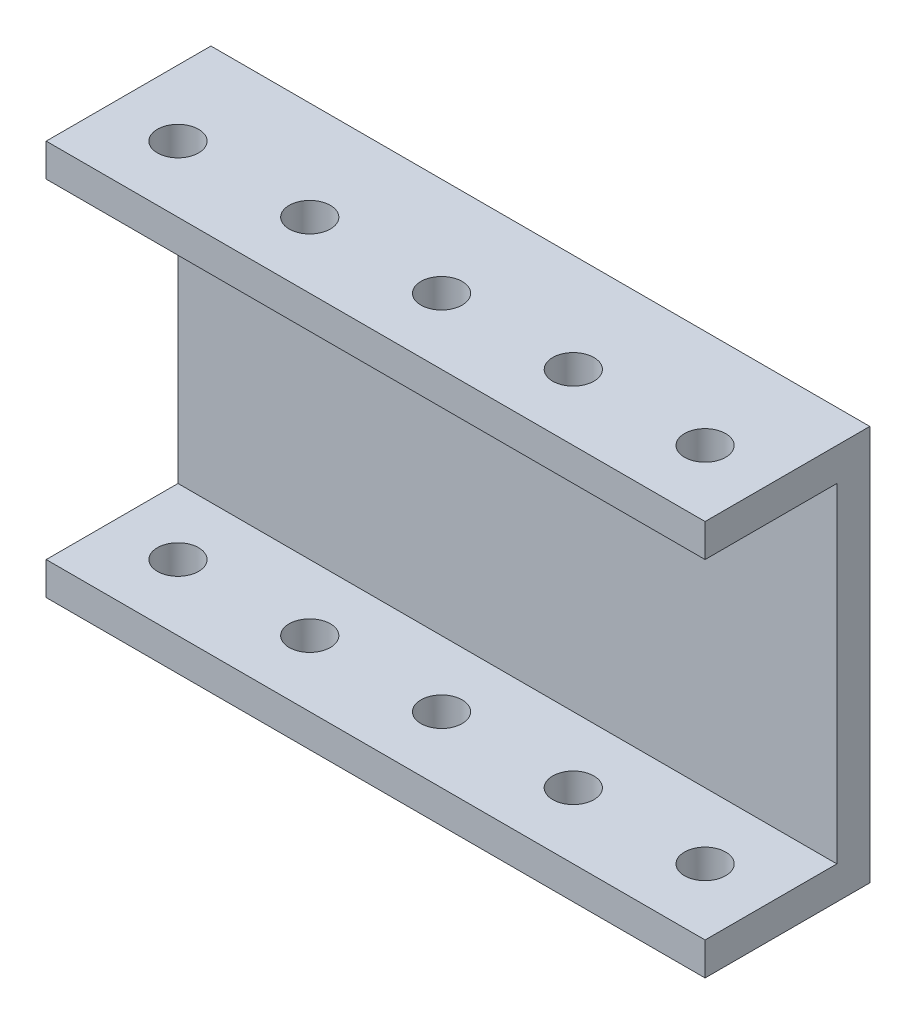
ISO-10303-21;
HEADER;
FILE_DESCRIPTION(('STEP AP214'),'2;1');
FILE_NAME('part.step','',(''),(''),'','','');
FILE_SCHEMA(('AUTOMOTIVE_DESIGN { 1 0 10303 214 1 1 1 1 }'));
ENDSEC;
DATA;
#1=APPLICATION_CONTEXT('core data for automotive mechanical design processes');
#2=APPLICATION_PROTOCOL_DEFINITION('international standard','automotive_design',2000,#1);
#3=PRODUCT_CONTEXT('',#1,'mechanical');
#4=PRODUCT('Part','Part','',(#3));
#5=PRODUCT_RELATED_PRODUCT_CATEGORY('part','',(#4));
#6=PRODUCT_DEFINITION_FORMATION('','',#4);
#7=PRODUCT_DEFINITION_CONTEXT('part definition',#1,'design');
#8=PRODUCT_DEFINITION('design','',#6,#7);
#9=PRODUCT_DEFINITION_SHAPE('','',#8);
#10=(LENGTH_UNIT() NAMED_UNIT(*) SI_UNIT(.MILLI.,.METRE.));
#11=(NAMED_UNIT(*) PLANE_ANGLE_UNIT() SI_UNIT($,.RADIAN.));
#12=(NAMED_UNIT(*) SI_UNIT($,.STERADIAN.) SOLID_ANGLE_UNIT());
#13=UNCERTAINTY_MEASURE_WITH_UNIT(LENGTH_MEASURE(1.E-05),#10,'distance_accuracy_value','');
#14=(GEOMETRIC_REPRESENTATION_CONTEXT(3) GLOBAL_UNCERTAINTY_ASSIGNED_CONTEXT((#13)) GLOBAL_UNIT_ASSIGNED_CONTEXT((#10,
#11,#12)) REPRESENTATION_CONTEXT('',''));
#15=CARTESIAN_POINT('',(0.,0.,0.));
#16=DIRECTION('',(0.,0.,1.));
#17=DIRECTION('',(1.,0.,0.));
#18=AXIS2_PLACEMENT_3D('',#15,#16,#17);
#19=CARTESIAN_POINT('',(127.,32.3974294572796,0.));
#20=DIRECTION('',(0.,1.,0.));
#21=DIRECTION('',(0.,0.,1.));
#22=AXIS2_PLACEMENT_3D('',#19,#20,#21);
#23=PLANE('',#22);
#24=CARTESIAN_POINT('',(12.7,32.3974294572796,-9.89046811553621));
#25=DIRECTION('',(0.,1.,0.));
#26=DIRECTION('',(0.,0.,1.));
#27=AXIS2_PLACEMENT_3D('',#24,#25,#26);
#28=CIRCLE('',#27,3.96874999999999);
#29=CARTESIAN_POINT('',(12.7,32.3974294572796,-5.92171811553622));
#30=VERTEX_POINT('',#29);
#31=EDGE_CURVE('E224',#30,#30,#28,.T.);
#32=ORIENTED_EDGE('',*,*,#31,.T.);
#33=EDGE_LOOP('',(#32));
#34=FACE_BOUND('',#33,.T.);
#35=CARTESIAN_POINT('',(38.1,32.3974294572796,-9.89046811553621));
#36=DIRECTION('',(0.,1.,0.));
#37=DIRECTION('',(0.,0.,1.));
#38=AXIS2_PLACEMENT_3D('',#35,#36,#37);
#39=CIRCLE('',#38,3.96874999999999);
#40=CARTESIAN_POINT('',(38.1,32.3974294572796,-5.92171811553622));
#41=VERTEX_POINT('',#40);
#42=EDGE_CURVE('E212',#41,#41,#39,.T.);
#43=ORIENTED_EDGE('',*,*,#42,.T.);
#44=EDGE_LOOP('',(#43));
#45=FACE_BOUND('',#44,.T.);
#46=CARTESIAN_POINT('',(63.5,32.3974294572796,-9.89046811553621));
#47=DIRECTION('',(0.,1.,0.));
#48=DIRECTION('',(0.,0.,1.));
#49=AXIS2_PLACEMENT_3D('',#46,#47,#48);
#50=CIRCLE('',#49,3.96874999999999);
#51=CARTESIAN_POINT('',(63.5,32.3974294572796,-5.92171811553622));
#52=VERTEX_POINT('',#51);
#53=EDGE_CURVE('E200',#52,#52,#50,.T.);
#54=ORIENTED_EDGE('',*,*,#53,.T.);
#55=EDGE_LOOP('',(#54));
#56=FACE_BOUND('',#55,.T.);
#57=CARTESIAN_POINT('',(88.9,32.3974294572796,-9.89046811553622));
#58=DIRECTION('',(0.,1.,0.));
#59=DIRECTION('',(0.,0.,1.));
#60=AXIS2_PLACEMENT_3D('',#57,#58,#59);
#61=CIRCLE('',#60,3.96874999999999);
#62=CARTESIAN_POINT('',(88.9,32.3974294572796,-5.92171811553623));
#63=VERTEX_POINT('',#62);
#64=EDGE_CURVE('E188',#63,#63,#61,.T.);
#65=ORIENTED_EDGE('',*,*,#64,.T.);
#66=EDGE_LOOP('',(#65));
#67=FACE_BOUND('',#66,.T.);
#68=CARTESIAN_POINT('',(114.3,32.3974294572796,-9.89046811553622));
#69=DIRECTION('',(0.,1.,0.));
#70=DIRECTION('',(0.,0.,1.));
#71=AXIS2_PLACEMENT_3D('',#68,#69,#70);
#72=CIRCLE('',#71,3.96874999999999);
#73=CARTESIAN_POINT('',(114.3,32.3974294572796,-5.92171811553623));
#74=VERTEX_POINT('',#73);
#75=EDGE_CURVE('E136',#74,#74,#72,.T.);
#76=ORIENTED_EDGE('',*,*,#75,.T.);
#77=EDGE_LOOP('',(#76));
#78=FACE_BOUND('',#77,.T.);
#79=DIRECTION('',(0.,0.,-1.));
#80=VECTOR('',#79,1.);
#81=CARTESIAN_POINT('',(0.,32.3974294572796,0.));
#82=LINE('',#81,#80);
#83=CARTESIAN_POINT('',(0.,32.3974294572796,2.80953188446378));
#84=VERTEX_POINT('',#83);
#85=CARTESIAN_POINT('',(0.,32.3974294572796,-22.5904681155362));
#86=VERTEX_POINT('',#85);
#87=EDGE_CURVE('E132',#84,#86,#82,.T.);
#88=ORIENTED_EDGE('',*,*,#87,.T.);
#89=DIRECTION('',(-1.,0.,0.));
#90=VECTOR('',#89,1.);
#91=CARTESIAN_POINT('',(127.,32.3974294572796,-22.5904681155362));
#92=LINE('',#91,#90);
#93=CARTESIAN_POINT('',(127.,32.3974294572796,-22.5904681155362));
#94=VERTEX_POINT('',#93);
#95=EDGE_CURVE('E11',#94,#86,#92,.T.);
#96=ORIENTED_EDGE('',*,*,#95,.F.);
#97=DIRECTION('',(0.,0.,-1.));
#98=VECTOR('',#97,1.);
#99=CARTESIAN_POINT('',(127.,32.3974294572796,0.));
#100=LINE('',#99,#98);
#101=CARTESIAN_POINT('',(127.,32.3974294572796,2.80953188446378));
#102=VERTEX_POINT('',#101);
#103=EDGE_CURVE('E151',#102,#94,#100,.T.);
#104=ORIENTED_EDGE('',*,*,#103,.F.);
#105=DIRECTION('',(-1.,0.,0.));
#106=VECTOR('',#105,1.);
#107=CARTESIAN_POINT('',(127.,32.3974294572796,2.80953188446378));
#108=LINE('',#107,#106);
#109=EDGE_CURVE('E128',#102,#84,#108,.T.);
#110=ORIENTED_EDGE('',*,*,#109,.T.);
#111=EDGE_LOOP('',(#88,#96,#104,#110));
#112=FACE_BOUND('',#111,.T.);
#113=ADVANCED_FACE('F37',(#34,#45,#56,#67,#78,#112),#23,.F.);
#114=CARTESIAN_POINT('',(127.,0.,-22.5904681155362));
#115=DIRECTION('',(0.,0.,-1.));
#116=DIRECTION('',(-1.,0.,0.));
#117=AXIS2_PLACEMENT_3D('',#114,#115,#116);
#118=PLANE('',#117);
#119=DIRECTION('',(0.,-1.,0.));
#120=VECTOR('',#119,1.);
#121=CARTESIAN_POINT('',(0.,0.,-22.5904681155362));
#122=LINE('',#121,#120);
#123=CARTESIAN_POINT('',(0.,-31.1025705427204,-22.5904681155362));
#124=VERTEX_POINT('',#123);
#125=EDGE_CURVE('E135',#86,#124,#122,.T.);
#126=ORIENTED_EDGE('',*,*,#125,.T.);
#127=DIRECTION('',(-1.,0.,0.));
#128=VECTOR('',#127,1.);
#129=CARTESIAN_POINT('',(127.,-31.1025705427204,-22.5904681155362));
#130=LINE('',#129,#128);
#131=CARTESIAN_POINT('',(127.,-31.1025705427204,-22.5904681155362));
#132=VERTEX_POINT('',#131);
#133=EDGE_CURVE('E45',#132,#124,#130,.T.);
#134=ORIENTED_EDGE('',*,*,#133,.F.);
#135=DIRECTION('',(0.,-1.,0.));
#136=VECTOR('',#135,1.);
#137=CARTESIAN_POINT('',(127.,0.,-22.5904681155362));
#138=LINE('',#137,#136);
#139=EDGE_CURVE('E92',#94,#132,#138,.T.);
#140=ORIENTED_EDGE('',*,*,#139,.F.);
#141=ORIENTED_EDGE('',*,*,#95,.T.);
#142=EDGE_LOOP('',(#126,#134,#140,#141));
#143=FACE_BOUND('',#142,.T.);
#144=ADVANCED_FACE('F251',(#143),#118,.F.);
#145=CARTESIAN_POINT('',(127.,-31.1025705427204,0.));
#146=DIRECTION('',(0.,-1.,0.));
#147=DIRECTION('',(0.,0.,-1.));
#148=AXIS2_PLACEMENT_3D('',#145,#146,#147);
#149=PLANE('',#148);
#150=CARTESIAN_POINT('',(12.7,-31.1025705427204,-9.89046811553621));
#151=DIRECTION('',(0.,-1.,0.));
#152=DIRECTION('',(0.,0.,-1.));
#153=AXIS2_PLACEMENT_3D('',#150,#151,#152);
#154=CIRCLE('',#153,3.96874999999999);
#155=CARTESIAN_POINT('',(12.7,-31.1025705427204,-13.8592181155362));
#156=VERTEX_POINT('',#155);
#157=EDGE_CURVE('E229',#156,#156,#154,.T.);
#158=ORIENTED_EDGE('',*,*,#157,.T.);
#159=EDGE_LOOP('',(#158));
#160=FACE_BOUND('',#159,.T.);
#161=CARTESIAN_POINT('',(38.1,-31.1025705427204,-9.89046811553621));
#162=DIRECTION('',(0.,-1.,0.));
#163=DIRECTION('',(0.,0.,-1.));
#164=AXIS2_PLACEMENT_3D('',#161,#162,#163);
#165=CIRCLE('',#164,3.96874999999999);
#166=CARTESIAN_POINT('',(38.1,-31.1025705427204,-13.8592181155362));
#167=VERTEX_POINT('',#166);
#168=EDGE_CURVE('E217',#167,#167,#165,.T.);
#169=ORIENTED_EDGE('',*,*,#168,.T.);
#170=EDGE_LOOP('',(#169));
#171=FACE_BOUND('',#170,.T.);
#172=CARTESIAN_POINT('',(63.5,-31.1025705427204,-9.89046811553621));
#173=DIRECTION('',(0.,-1.,0.));
#174=DIRECTION('',(0.,0.,-1.));
#175=AXIS2_PLACEMENT_3D('',#172,#173,#174);
#176=CIRCLE('',#175,3.96874999999999);
#177=CARTESIAN_POINT('',(63.5,-31.1025705427204,-13.8592181155362));
#178=VERTEX_POINT('',#177);
#179=EDGE_CURVE('E205',#178,#178,#176,.T.);
#180=ORIENTED_EDGE('',*,*,#179,.T.);
#181=EDGE_LOOP('',(#180));
#182=FACE_BOUND('',#181,.T.);
#183=CARTESIAN_POINT('',(88.9,-31.1025705427204,-9.89046811553622));
#184=DIRECTION('',(0.,-1.,0.));
#185=DIRECTION('',(0.,0.,-1.));
#186=AXIS2_PLACEMENT_3D('',#183,#184,#185);
#187=CIRCLE('',#186,3.96874999999999);
#188=CARTESIAN_POINT('',(88.9,-31.1025705427204,-13.8592181155362));
#189=VERTEX_POINT('',#188);
#190=EDGE_CURVE('E193',#189,#189,#187,.T.);
#191=ORIENTED_EDGE('',*,*,#190,.T.);
#192=EDGE_LOOP('',(#191));
#193=FACE_BOUND('',#192,.T.);
#194=CARTESIAN_POINT('',(114.3,-31.1025705427204,-9.89046811553622));
#195=DIRECTION('',(0.,-1.,0.));
#196=DIRECTION('',(0.,0.,-1.));
#197=AXIS2_PLACEMENT_3D('',#194,#195,#196);
#198=CIRCLE('',#197,3.96874999999999);
#199=CARTESIAN_POINT('',(114.3,-31.1025705427204,-13.8592181155362));
#200=VERTEX_POINT('',#199);
#201=EDGE_CURVE('E181',#200,#200,#198,.T.);
#202=ORIENTED_EDGE('',*,*,#201,.T.);
#203=EDGE_LOOP('',(#202));
#204=FACE_BOUND('',#203,.T.);
#205=DIRECTION('',(0.,0.,1.));
#206=VECTOR('',#205,1.);
#207=CARTESIAN_POINT('',(0.,-31.1025705427204,0.));
#208=LINE('',#207,#206);
#209=CARTESIAN_POINT('',(0.,-31.1025705427204,2.80953188446379));
#210=VERTEX_POINT('',#209);
#211=EDGE_CURVE('E138',#124,#210,#208,.T.);
#212=ORIENTED_EDGE('',*,*,#211,.T.);
#213=DIRECTION('',(-1.,0.,0.));
#214=VECTOR('',#213,1.);
#215=CARTESIAN_POINT('',(127.,-31.1025705427204,2.80953188446379));
#216=LINE('',#215,#214);
#217=CARTESIAN_POINT('',(127.,-31.1025705427204,2.80953188446379));
#218=VERTEX_POINT('',#217);
#219=EDGE_CURVE('E157',#218,#210,#216,.T.);
#220=ORIENTED_EDGE('',*,*,#219,.F.);
#221=DIRECTION('',(0.,0.,1.));
#222=VECTOR('',#221,1.);
#223=CARTESIAN_POINT('',(127.,-31.1025705427204,0.));
#224=LINE('',#223,#222);
#225=EDGE_CURVE('E164',#132,#218,#224,.T.);
#226=ORIENTED_EDGE('',*,*,#225,.F.);
#227=ORIENTED_EDGE('',*,*,#133,.T.);
#228=EDGE_LOOP('',(#212,#220,#226,#227));
#229=FACE_BOUND('',#228,.T.);
#230=ADVANCED_FACE('F162',(#160,#171,#182,#193,#204,#229),#149,.F.);
#231=CARTESIAN_POINT('',(127.,0.,2.80953188446379));
#232=DIRECTION('',(0.,0.,1.));
#233=DIRECTION('',(0.,-1.,0.));
#234=AXIS2_PLACEMENT_3D('',#231,#232,#233);
#235=PLANE('',#234);
#236=DIRECTION('',(0.,1.,0.));
#237=VECTOR('',#236,1.);
#238=CARTESIAN_POINT('',(0.,0.,2.80953188446379));
#239=LINE('',#238,#237);
#240=CARTESIAN_POINT('',(0.,-37.4525705427204,2.80953188446378));
#241=VERTEX_POINT('',#240);
#242=EDGE_CURVE('E141',#241,#210,#239,.T.);
#243=ORIENTED_EDGE('',*,*,#242,.F.);
#244=DIRECTION('',(-1.,0.,0.));
#245=VECTOR('',#244,1.);
#246=CARTESIAN_POINT('',(127.,-37.4525705427204,2.80953188446378));
#247=LINE('',#246,#245);
#248=CARTESIAN_POINT('',(127.,-37.4525705427204,2.80953188446378));
#249=VERTEX_POINT('',#248);
#250=EDGE_CURVE('E155',#249,#241,#247,.T.);
#251=ORIENTED_EDGE('',*,*,#250,.F.);
#252=DIRECTION('',(0.,1.,0.));
#253=VECTOR('',#252,1.);
#254=CARTESIAN_POINT('',(127.,0.,2.80953188446379));
#255=LINE('',#254,#253);
#256=EDGE_CURVE('E173',#249,#218,#255,.T.);
#257=ORIENTED_EDGE('',*,*,#256,.T.);
#258=ORIENTED_EDGE('',*,*,#219,.T.);
#259=EDGE_LOOP('',(#243,#251,#257,#258));
#260=FACE_BOUND('',#259,.T.);
#261=ADVANCED_FACE('F171',(#260),#235,.T.);
#262=CARTESIAN_POINT('',(127.,-37.4525705427204,0.));
#263=DIRECTION('',(0.,1.,0.));
#264=DIRECTION('',(0.,0.,1.));
#265=AXIS2_PLACEMENT_3D('',#262,#263,#264);
#266=PLANE('',#265);
#267=CARTESIAN_POINT('',(12.7,-37.4525705427204,-9.89046811553621));
#268=DIRECTION('',(0.,1.,0.));
#269=DIRECTION('',(0.,0.,1.));
#270=AXIS2_PLACEMENT_3D('',#267,#268,#269);
#271=CIRCLE('',#270,3.96874999999999);
#272=CARTESIAN_POINT('',(12.7,-37.4525705427204,-5.92171811553622));
#273=VERTEX_POINT('',#272);
#274=EDGE_CURVE('E232',#273,#273,#271,.T.);
#275=ORIENTED_EDGE('',*,*,#274,.T.);
#276=EDGE_LOOP('',(#275));
#277=FACE_BOUND('',#276,.T.);
#278=CARTESIAN_POINT('',(38.1,-37.4525705427204,-9.89046811553621));
#279=DIRECTION('',(0.,1.,0.));
#280=DIRECTION('',(0.,0.,1.));
#281=AXIS2_PLACEMENT_3D('',#278,#279,#280);
#282=CIRCLE('',#281,3.96874999999999);
#283=CARTESIAN_POINT('',(38.1,-37.4525705427204,-5.92171811553622));
#284=VERTEX_POINT('',#283);
#285=EDGE_CURVE('E220',#284,#284,#282,.T.);
#286=ORIENTED_EDGE('',*,*,#285,.T.);
#287=EDGE_LOOP('',(#286));
#288=FACE_BOUND('',#287,.T.);
#289=CARTESIAN_POINT('',(63.5,-37.4525705427204,-9.89046811553621));
#290=DIRECTION('',(0.,1.,0.));
#291=DIRECTION('',(0.,0.,1.));
#292=AXIS2_PLACEMENT_3D('',#289,#290,#291);
#293=CIRCLE('',#292,3.96874999999999);
#294=CARTESIAN_POINT('',(63.5,-37.4525705427204,-5.92171811553622));
#295=VERTEX_POINT('',#294);
#296=EDGE_CURVE('E208',#295,#295,#293,.T.);
#297=ORIENTED_EDGE('',*,*,#296,.T.);
#298=EDGE_LOOP('',(#297));
#299=FACE_BOUND('',#298,.T.);
#300=CARTESIAN_POINT('',(88.9,-37.4525705427204,-9.89046811553622));
#301=DIRECTION('',(0.,1.,0.));
#302=DIRECTION('',(0.,0.,1.));
#303=AXIS2_PLACEMENT_3D('',#300,#301,#302);
#304=CIRCLE('',#303,3.96874999999999);
#305=CARTESIAN_POINT('',(88.9,-37.4525705427204,-5.92171811553623));
#306=VERTEX_POINT('',#305);
#307=EDGE_CURVE('E196',#306,#306,#304,.T.);
#308=ORIENTED_EDGE('',*,*,#307,.T.);
#309=EDGE_LOOP('',(#308));
#310=FACE_BOUND('',#309,.T.);
#311=CARTESIAN_POINT('',(114.3,-37.4525705427204,-9.89046811553622));
#312=DIRECTION('',(0.,1.,0.));
#313=DIRECTION('',(0.,0.,1.));
#314=AXIS2_PLACEMENT_3D('',#311,#312,#313);
#315=CIRCLE('',#314,3.96874999999999);
#316=CARTESIAN_POINT('',(114.3,-37.4525705427204,-5.92171811553623));
#317=VERTEX_POINT('',#316);
#318=EDGE_CURVE('E184',#317,#317,#315,.T.);
#319=ORIENTED_EDGE('',*,*,#318,.T.);
#320=EDGE_LOOP('',(#319));
#321=FACE_BOUND('',#320,.T.);
#322=DIRECTION('',(0.,0.,-1.));
#323=VECTOR('',#322,1.);
#324=CARTESIAN_POINT('',(0.,-37.4525705427204,0.));
#325=LINE('',#324,#323);
#326=CARTESIAN_POINT('',(0.,-37.4525705427204,-28.9404681155362));
#327=VERTEX_POINT('',#326);
#328=EDGE_CURVE('E144',#241,#327,#325,.T.);
#329=ORIENTED_EDGE('',*,*,#328,.T.);
#330=DIRECTION('',(-1.,0.,0.));
#331=VECTOR('',#330,1.);
#332=CARTESIAN_POINT('',(127.,-37.4525705427204,-28.9404681155362));
#333=LINE('',#332,#331);
#334=CARTESIAN_POINT('',(127.,-37.4525705427204,-28.9404681155362));
#335=VERTEX_POINT('',#334);
#336=EDGE_CURVE('E117',#335,#327,#333,.T.);
#337=ORIENTED_EDGE('',*,*,#336,.F.);
#338=DIRECTION('',(0.,0.,-1.));
#339=VECTOR('',#338,1.);
#340=CARTESIAN_POINT('',(127.,-37.4525705427204,0.));
#341=LINE('',#340,#339);
#342=EDGE_CURVE('E123',#249,#335,#341,.T.);
#343=ORIENTED_EDGE('',*,*,#342,.F.);
#344=ORIENTED_EDGE('',*,*,#250,.T.);
#345=EDGE_LOOP('',(#329,#337,#343,#344));
#346=FACE_BOUND('',#345,.T.);
#347=ADVANCED_FACE('F239',(#277,#288,#299,#310,#321,#346),#266,.F.);
#348=CARTESIAN_POINT('',(127.,0.,-28.9404681155362));
#349=DIRECTION('',(0.,0.,-1.));
#350=DIRECTION('',(0.,1.,0.));
#351=AXIS2_PLACEMENT_3D('',#348,#349,#350);
#352=PLANE('',#351);
#353=DIRECTION('',(0.,-1.,0.));
#354=VECTOR('',#353,1.);
#355=CARTESIAN_POINT('',(0.,0.,-28.9404681155362));
#356=LINE('',#355,#354);
#357=CARTESIAN_POINT('',(0.,38.7474294572796,-28.9404681155362));
#358=VERTEX_POINT('',#357);
#359=EDGE_CURVE('E112',#358,#327,#356,.T.);
#360=ORIENTED_EDGE('',*,*,#359,.F.);
#361=DIRECTION('',(-1.,0.,0.));
#362=VECTOR('',#361,1.);
#363=CARTESIAN_POINT('',(127.,38.7474294572796,-28.9404681155362));
#364=LINE('',#363,#362);
#365=CARTESIAN_POINT('',(127.,38.7474294572796,-28.9404681155362));
#366=VERTEX_POINT('',#365);
#367=EDGE_CURVE('E107',#366,#358,#364,.T.);
#368=ORIENTED_EDGE('',*,*,#367,.F.);
#369=DIRECTION('',(0.,-1.,0.));
#370=VECTOR('',#369,1.);
#371=CARTESIAN_POINT('',(127.,0.,-28.9404681155362));
#372=LINE('',#371,#370);
#373=EDGE_CURVE('E110',#366,#335,#372,.T.);
#374=ORIENTED_EDGE('',*,*,#373,.T.);
#375=ORIENTED_EDGE('',*,*,#336,.T.);
#376=EDGE_LOOP('',(#360,#368,#374,#375));
#377=FACE_BOUND('',#376,.T.);
#378=ADVANCED_FACE('F109',(#377),#352,.T.);
#379=CARTESIAN_POINT('',(127.,38.7474294572796,0.));
#380=DIRECTION('',(0.,1.,0.));
#381=DIRECTION('',(0.,0.,1.));
#382=AXIS2_PLACEMENT_3D('',#379,#380,#381);
#383=PLANE('',#382);
#384=CARTESIAN_POINT('',(12.7,38.7474294572796,-9.89046811553621));
#385=DIRECTION('',(0.,1.,0.));
#386=DIRECTION('',(0.,0.,1.));
#387=AXIS2_PLACEMENT_3D('',#384,#385,#386);
#388=CIRCLE('',#387,3.96874999999999);
#389=CARTESIAN_POINT('',(12.7,38.7474294572796,-5.92171811553622));
#390=VERTEX_POINT('',#389);
#391=EDGE_CURVE('E233',#390,#390,#388,.T.);
#392=ORIENTED_EDGE('',*,*,#391,.F.);
#393=EDGE_LOOP('',(#392));
#394=FACE_BOUND('',#393,.T.);
#395=CARTESIAN_POINT('',(38.1,38.7474294572796,-9.89046811553621));
#396=DIRECTION('',(0.,1.,0.));
#397=DIRECTION('',(0.,0.,1.));
#398=AXIS2_PLACEMENT_3D('',#395,#396,#397);
#399=CIRCLE('',#398,3.96874999999999);
#400=CARTESIAN_POINT('',(38.1,38.7474294572796,-5.92171811553622));
#401=VERTEX_POINT('',#400);
#402=EDGE_CURVE('E221',#401,#401,#399,.T.);
#403=ORIENTED_EDGE('',*,*,#402,.F.);
#404=EDGE_LOOP('',(#403));
#405=FACE_BOUND('',#404,.T.);
#406=CARTESIAN_POINT('',(63.5,38.7474294572796,-9.89046811553621));
#407=DIRECTION('',(0.,1.,0.));
#408=DIRECTION('',(0.,0.,1.));
#409=AXIS2_PLACEMENT_3D('',#406,#407,#408);
#410=CIRCLE('',#409,3.96874999999999);
#411=CARTESIAN_POINT('',(63.5,38.7474294572796,-5.92171811553622));
#412=VERTEX_POINT('',#411);
#413=EDGE_CURVE('E209',#412,#412,#410,.T.);
#414=ORIENTED_EDGE('',*,*,#413,.F.);
#415=EDGE_LOOP('',(#414));
#416=FACE_BOUND('',#415,.T.);
#417=CARTESIAN_POINT('',(88.9,38.7474294572796,-9.89046811553622));
#418=DIRECTION('',(0.,1.,0.));
#419=DIRECTION('',(0.,0.,1.));
#420=AXIS2_PLACEMENT_3D('',#417,#418,#419);
#421=CIRCLE('',#420,3.96874999999999);
#422=CARTESIAN_POINT('',(88.9,38.7474294572796,-5.92171811553623));
#423=VERTEX_POINT('',#422);
#424=EDGE_CURVE('E197',#423,#423,#421,.T.);
#425=ORIENTED_EDGE('',*,*,#424,.F.);
#426=EDGE_LOOP('',(#425));
#427=FACE_BOUND('',#426,.T.);
#428=CARTESIAN_POINT('',(114.3,38.7474294572796,-9.89046811553622));
#429=DIRECTION('',(0.,1.,0.));
#430=DIRECTION('',(0.,0.,1.));
#431=AXIS2_PLACEMENT_3D('',#428,#429,#430);
#432=CIRCLE('',#431,3.96874999999999);
#433=CARTESIAN_POINT('',(114.3,38.7474294572796,-5.92171811553623));
#434=VERTEX_POINT('',#433);
#435=EDGE_CURVE('E185',#434,#434,#432,.T.);
#436=ORIENTED_EDGE('',*,*,#435,.F.);
#437=EDGE_LOOP('',(#436));
#438=FACE_BOUND('',#437,.T.);
#439=DIRECTION('',(0.,0.,-1.));
#440=VECTOR('',#439,1.);
#441=CARTESIAN_POINT('',(0.,38.7474294572796,0.));
#442=LINE('',#441,#440);
#443=CARTESIAN_POINT('',(0.,38.7474294572796,2.80953188446378));
#444=VERTEX_POINT('',#443);
#445=EDGE_CURVE('E148',#444,#358,#442,.T.);
#446=ORIENTED_EDGE('',*,*,#445,.F.);
#447=DIRECTION('',(-1.,0.,0.));
#448=VECTOR('',#447,1.);
#449=CARTESIAN_POINT('',(127.,38.7474294572796,2.80953188446378));
#450=LINE('',#449,#448);
#451=CARTESIAN_POINT('',(127.,38.7474294572796,2.80953188446378));
#452=VERTEX_POINT('',#451);
#453=EDGE_CURVE('E81',#452,#444,#450,.T.);
#454=ORIENTED_EDGE('',*,*,#453,.F.);
#455=DIRECTION('',(0.,0.,-1.));
#456=VECTOR('',#455,1.);
#457=CARTESIAN_POINT('',(127.,38.7474294572796,0.));
#458=LINE('',#457,#456);
#459=EDGE_CURVE('E120',#452,#366,#458,.T.);
#460=ORIENTED_EDGE('',*,*,#459,.T.);
#461=ORIENTED_EDGE('',*,*,#367,.T.);
#462=EDGE_LOOP('',(#446,#454,#460,#461));
#463=FACE_BOUND('',#462,.T.);
#464=ADVANCED_FACE('F126',(#394,#405,#416,#427,#438,#463),#383,.T.);
#465=CARTESIAN_POINT('',(127.,0.,2.80953188446378));
#466=DIRECTION('',(0.,0.,-1.));
#467=DIRECTION('',(0.,1.,0.));
#468=AXIS2_PLACEMENT_3D('',#465,#466,#467);
#469=PLANE('',#468);
#470=DIRECTION('',(0.,-1.,0.));
#471=VECTOR('',#470,1.);
#472=CARTESIAN_POINT('',(0.,0.,2.80953188446378));
#473=LINE('',#472,#471);
#474=EDGE_CURVE('E84',#444,#84,#473,.T.);
#475=ORIENTED_EDGE('',*,*,#474,.T.);
#476=ORIENTED_EDGE('',*,*,#109,.F.);
#477=DIRECTION('',(0.,-1.,0.));
#478=VECTOR('',#477,1.);
#479=CARTESIAN_POINT('',(127.,0.,2.80953188446378));
#480=LINE('',#479,#478);
#481=EDGE_CURVE('E53',#452,#102,#480,.T.);
#482=ORIENTED_EDGE('',*,*,#481,.F.);
#483=ORIENTED_EDGE('',*,*,#453,.T.);
#484=EDGE_LOOP('',(#475,#476,#482,#483));
#485=FACE_BOUND('',#484,.T.);
#486=ADVANCED_FACE('F294',(#485),#469,.F.);
#487=CARTESIAN_POINT('',(127.,0.,0.));
#488=DIRECTION('',(1.,0.,0.));
#489=DIRECTION('',(0.,0.,-1.));
#490=AXIS2_PLACEMENT_3D('',#487,#488,#489);
#491=PLANE('',#490);
#492=ORIENTED_EDGE('',*,*,#103,.T.);
#493=ORIENTED_EDGE('',*,*,#139,.T.);
#494=ORIENTED_EDGE('',*,*,#225,.T.);
#495=ORIENTED_EDGE('',*,*,#256,.F.);
#496=ORIENTED_EDGE('',*,*,#342,.T.);
#497=ORIENTED_EDGE('',*,*,#373,.F.);
#498=ORIENTED_EDGE('',*,*,#459,.F.);
#499=ORIENTED_EDGE('',*,*,#481,.T.);
#500=EDGE_LOOP('',(#492,#493,#494,#495,#496,#497,#498,#499));
#501=FACE_BOUND('',#500,.T.);
#502=ADVANCED_FACE('F119',(#501),#491,.T.);
#503=CARTESIAN_POINT('',(0.,0.,0.));
#504=DIRECTION('',(1.,0.,0.));
#505=DIRECTION('',(0.,0.,-1.));
#506=AXIS2_PLACEMENT_3D('',#503,#504,#505);
#507=PLANE('',#506);
#508=ORIENTED_EDGE('',*,*,#87,.F.);
#509=ORIENTED_EDGE('',*,*,#474,.F.);
#510=ORIENTED_EDGE('',*,*,#445,.T.);
#511=ORIENTED_EDGE('',*,*,#359,.T.);
#512=ORIENTED_EDGE('',*,*,#328,.F.);
#513=ORIENTED_EDGE('',*,*,#242,.T.);
#514=ORIENTED_EDGE('',*,*,#211,.F.);
#515=ORIENTED_EDGE('',*,*,#125,.F.);
#516=EDGE_LOOP('',(#508,#509,#510,#511,#512,#513,#514,#515));
#517=FACE_BOUND('',#516,.T.);
#518=ADVANCED_FACE('F167',(#517),#507,.F.);
#519=CARTESIAN_POINT('',(114.3,-37.4525705427204,-9.89046811553622));
#520=DIRECTION('',(0.,1.,0.));
#521=DIRECTION('',(0.,0.,1.));
#522=AXIS2_PLACEMENT_3D('',#519,#520,#521);
#523=CYLINDRICAL_SURFACE('',#522,3.96874999999999);
#524=ORIENTED_EDGE('',*,*,#435,.T.);
#525=EDGE_LOOP('',(#524));
#526=FACE_BOUND('',#525,.T.);
#527=ORIENTED_EDGE('',*,*,#75,.F.);
#528=EDGE_LOOP('',(#527));
#529=FACE_BOUND('',#528,.T.);
#530=ADVANCED_FACE('F264',(#526,#529),#523,.F.);
#531=ORIENTED_EDGE('',*,*,#318,.F.);
#532=EDGE_LOOP('',(#531));
#533=FACE_BOUND('',#532,.T.);
#534=ORIENTED_EDGE('',*,*,#201,.F.);
#535=EDGE_LOOP('',(#534));
#536=FACE_BOUND('',#535,.T.);
#537=ADVANCED_FACE('F261',(#533,#536),#523,.F.);
#538=CARTESIAN_POINT('',(88.9,-37.4525705427204,-9.89046811553622));
#539=DIRECTION('',(0.,1.,0.));
#540=DIRECTION('',(0.,0.,1.));
#541=AXIS2_PLACEMENT_3D('',#538,#539,#540);
#542=CYLINDRICAL_SURFACE('',#541,3.96874999999999);
#543=ORIENTED_EDGE('',*,*,#424,.T.);
#544=EDGE_LOOP('',(#543));
#545=FACE_BOUND('',#544,.T.);
#546=ORIENTED_EDGE('',*,*,#64,.F.);
#547=EDGE_LOOP('',(#546));
#548=FACE_BOUND('',#547,.T.);
#549=ADVANCED_FACE('F263',(#545,#548),#542,.F.);
#550=ORIENTED_EDGE('',*,*,#307,.F.);
#551=EDGE_LOOP('',(#550));
#552=FACE_BOUND('',#551,.T.);
#553=ORIENTED_EDGE('',*,*,#190,.F.);
#554=EDGE_LOOP('',(#553));
#555=FACE_BOUND('',#554,.T.);
#556=ADVANCED_FACE('F271',(#552,#555),#542,.F.);
#557=CARTESIAN_POINT('',(63.5,-37.4525705427204,-9.89046811553621));
#558=DIRECTION('',(0.,1.,0.));
#559=DIRECTION('',(0.,0.,1.));
#560=AXIS2_PLACEMENT_3D('',#557,#558,#559);
#561=CYLINDRICAL_SURFACE('',#560,3.96874999999999);
#562=ORIENTED_EDGE('',*,*,#413,.T.);
#563=EDGE_LOOP('',(#562));
#564=FACE_BOUND('',#563,.T.);
#565=ORIENTED_EDGE('',*,*,#53,.F.);
#566=EDGE_LOOP('',(#565));
#567=FACE_BOUND('',#566,.T.);
#568=ADVANCED_FACE('F356',(#564,#567),#561,.F.);
#569=ORIENTED_EDGE('',*,*,#296,.F.);
#570=EDGE_LOOP('',(#569));
#571=FACE_BOUND('',#570,.T.);
#572=ORIENTED_EDGE('',*,*,#179,.F.);
#573=EDGE_LOOP('',(#572));
#574=FACE_BOUND('',#573,.T.);
#575=ADVANCED_FACE('F365',(#571,#574),#561,.F.);
#576=CARTESIAN_POINT('',(38.1,-37.4525705427204,-9.89046811553621));
#577=DIRECTION('',(0.,1.,0.));
#578=DIRECTION('',(0.,0.,1.));
#579=AXIS2_PLACEMENT_3D('',#576,#577,#578);
#580=CYLINDRICAL_SURFACE('',#579,3.96874999999999);
#581=ORIENTED_EDGE('',*,*,#402,.T.);
#582=EDGE_LOOP('',(#581));
#583=FACE_BOUND('',#582,.T.);
#584=ORIENTED_EDGE('',*,*,#42,.F.);
#585=EDGE_LOOP('',(#584));
#586=FACE_BOUND('',#585,.T.);
#587=ADVANCED_FACE('F375',(#583,#586),#580,.F.);
#588=ORIENTED_EDGE('',*,*,#285,.F.);
#589=EDGE_LOOP('',(#588));
#590=FACE_BOUND('',#589,.T.);
#591=ORIENTED_EDGE('',*,*,#168,.F.);
#592=EDGE_LOOP('',(#591));
#593=FACE_BOUND('',#592,.T.);
#594=ADVANCED_FACE('F384',(#590,#593),#580,.F.);
#595=CARTESIAN_POINT('',(12.7,-37.4525705427204,-9.89046811553621));
#596=DIRECTION('',(0.,1.,0.));
#597=DIRECTION('',(0.,0.,1.));
#598=AXIS2_PLACEMENT_3D('',#595,#596,#597);
#599=CYLINDRICAL_SURFACE('',#598,3.96874999999999);
#600=ORIENTED_EDGE('',*,*,#391,.T.);
#601=EDGE_LOOP('',(#600));
#602=FACE_BOUND('',#601,.T.);
#603=ORIENTED_EDGE('',*,*,#31,.F.);
#604=EDGE_LOOP('',(#603));
#605=FACE_BOUND('',#604,.T.);
#606=ADVANCED_FACE('F245',(#602,#605),#599,.F.);
#607=ORIENTED_EDGE('',*,*,#274,.F.);
#608=EDGE_LOOP('',(#607));
#609=FACE_BOUND('',#608,.T.);
#610=ORIENTED_EDGE('',*,*,#157,.F.);
#611=EDGE_LOOP('',(#610));
#612=FACE_BOUND('',#611,.T.);
#613=ADVANCED_FACE('F242',(#609,#612),#599,.F.);
#614=CLOSED_SHELL('',(#113,#144,#230,#261,#347,#378,#464,#486,#502,#518,#530,#537,#549,#556,
#568,#575,#587,#594,#606,#613));
#615=MANIFOLD_SOLID_BREP('B2',#614);
#616=ADVANCED_BREP_SHAPE_REPRESENTATION('',(#18,#615),#14);
#617=SHAPE_DEFINITION_REPRESENTATION(#9,#616);
ENDSEC;
END-ISO-10303-21;
